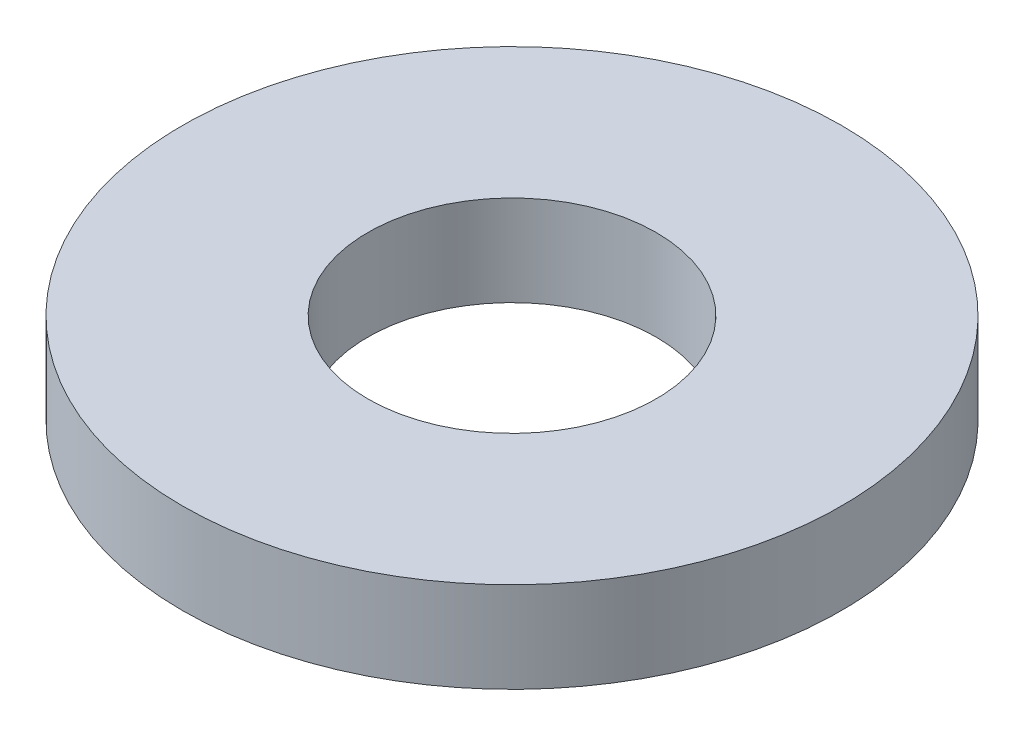
ISO-10303-21;
HEADER;
FILE_DESCRIPTION(('STEP AP214'),'2;1');
FILE_NAME('part.step','',(''),(''),'','','');
FILE_SCHEMA(('AUTOMOTIVE_DESIGN { 1 0 10303 214 1 1 1 1 }'));
ENDSEC;
DATA;
#1=APPLICATION_CONTEXT('core data for automotive mechanical design processes');
#2=APPLICATION_PROTOCOL_DEFINITION('international standard','automotive_design',2000,#1);
#3=PRODUCT_CONTEXT('',#1,'mechanical');
#4=PRODUCT('Part','Part','',(#3));
#5=PRODUCT_RELATED_PRODUCT_CATEGORY('part','',(#4));
#6=PRODUCT_DEFINITION_FORMATION('','',#4);
#7=PRODUCT_DEFINITION_CONTEXT('part definition',#1,'design');
#8=PRODUCT_DEFINITION('design','',#6,#7);
#9=PRODUCT_DEFINITION_SHAPE('','',#8);
#10=(LENGTH_UNIT() NAMED_UNIT(*) SI_UNIT(.MILLI.,.METRE.));
#11=(NAMED_UNIT(*) PLANE_ANGLE_UNIT() SI_UNIT($,.RADIAN.));
#12=(NAMED_UNIT(*) SI_UNIT($,.STERADIAN.) SOLID_ANGLE_UNIT());
#13=UNCERTAINTY_MEASURE_WITH_UNIT(LENGTH_MEASURE(1.E-05),#10,'distance_accuracy_value','');
#14=(GEOMETRIC_REPRESENTATION_CONTEXT(3) GLOBAL_UNCERTAINTY_ASSIGNED_CONTEXT((#13)) GLOBAL_UNIT_ASSIGNED_CONTEXT((#10,
#11,#12)) REPRESENTATION_CONTEXT('',''));
#15=CARTESIAN_POINT('',(0.,0.,0.));
#16=DIRECTION('',(0.,0.,1.));
#17=DIRECTION('',(1.,0.,0.));
#18=AXIS2_PLACEMENT_3D('',#15,#16,#17);
#19=CARTESIAN_POINT('',(0.,22.,0.));
#20=DIRECTION('',(0.,-1.,0.));
#21=DIRECTION('',(0.,0.,-1.));
#22=AXIS2_PLACEMENT_3D('',#19,#20,#21);
#23=CYLINDRICAL_SURFACE('',#22,80.);
#24=CARTESIAN_POINT('',(0.,22.,0.));
#25=DIRECTION('',(0.,1.,0.));
#26=DIRECTION('',(0.,0.,1.));
#27=AXIS2_PLACEMENT_3D('',#24,#25,#26);
#28=CIRCLE('',#27,80.);
#29=CARTESIAN_POINT('',(0.,22.,80.));
#30=VERTEX_POINT('',#29);
#31=EDGE_CURVE('E10',#30,#30,#28,.T.);
#32=ORIENTED_EDGE('',*,*,#31,.F.);
#33=EDGE_LOOP('',(#32));
#34=FACE_BOUND('',#33,.T.);
#35=CARTESIAN_POINT('',(0.,0.,0.));
#36=DIRECTION('',(0.,1.,0.));
#37=DIRECTION('',(0.,0.,1.));
#38=AXIS2_PLACEMENT_3D('',#35,#36,#37);
#39=CIRCLE('',#38,80.);
#40=CARTESIAN_POINT('',(0.,0.,80.));
#41=VERTEX_POINT('',#40);
#42=EDGE_CURVE('E37',#41,#41,#39,.T.);
#43=ORIENTED_EDGE('',*,*,#42,.T.);
#44=EDGE_LOOP('',(#43));
#45=FACE_BOUND('',#44,.T.);
#46=ADVANCED_FACE('F40',(#34,#45),#23,.T.);
#47=CARTESIAN_POINT('',(0.,22.,0.));
#48=DIRECTION('',(0.,1.,0.));
#49=DIRECTION('',(0.,0.,1.));
#50=AXIS2_PLACEMENT_3D('',#47,#48,#49);
#51=PLANE('',#50);
#52=CARTESIAN_POINT('',(0.,22.,0.));
#53=DIRECTION('',(0.,1.,0.));
#54=DIRECTION('',(0.,0.,1.));
#55=AXIS2_PLACEMENT_3D('',#52,#53,#54);
#56=CIRCLE('',#55,35.);
#57=CARTESIAN_POINT('',(0.,22.,35.));
#58=VERTEX_POINT('',#57);
#59=EDGE_CURVE('E50',#58,#58,#56,.T.);
#60=ORIENTED_EDGE('',*,*,#59,.F.);
#61=EDGE_LOOP('',(#60));
#62=FACE_BOUND('',#61,.T.);
#63=ORIENTED_EDGE('',*,*,#31,.T.);
#64=EDGE_LOOP('',(#63));
#65=FACE_BOUND('',#64,.T.);
#66=ADVANCED_FACE('F59',(#62,#65),#51,.T.);
#67=CARTESIAN_POINT('',(0.,0.,0.));
#68=DIRECTION('',(0.,1.,0.));
#69=DIRECTION('',(0.,0.,1.));
#70=AXIS2_PLACEMENT_3D('',#67,#68,#69);
#71=PLANE('',#70);
#72=CARTESIAN_POINT('',(0.,0.,0.));
#73=DIRECTION('',(0.,1.,0.));
#74=DIRECTION('',(0.,0.,1.));
#75=AXIS2_PLACEMENT_3D('',#72,#73,#74);
#76=CIRCLE('',#75,35.);
#77=CARTESIAN_POINT('',(0.,0.,35.));
#78=VERTEX_POINT('',#77);
#79=EDGE_CURVE('E47',#78,#78,#76,.T.);
#80=ORIENTED_EDGE('',*,*,#79,.T.);
#81=EDGE_LOOP('',(#80));
#82=FACE_BOUND('',#81,.T.);
#83=ORIENTED_EDGE('',*,*,#42,.F.);
#84=EDGE_LOOP('',(#83));
#85=FACE_BOUND('',#84,.T.);
#86=ADVANCED_FACE('F58',(#82,#85),#71,.F.);
#87=CARTESIAN_POINT('',(0.,22.,0.));
#88=DIRECTION('',(0.,-1.,0.));
#89=DIRECTION('',(0.,0.,-1.));
#90=AXIS2_PLACEMENT_3D('',#87,#88,#89);
#91=CYLINDRICAL_SURFACE('',#90,35.);
#92=ORIENTED_EDGE('',*,*,#59,.T.);
#93=EDGE_LOOP('',(#92));
#94=FACE_BOUND('',#93,.T.);
#95=ORIENTED_EDGE('',*,*,#79,.F.);
#96=EDGE_LOOP('',(#95));
#97=FACE_BOUND('',#96,.T.);
#98=ADVANCED_FACE('F54',(#94,#97),#91,.F.);
#99=CLOSED_SHELL('',(#46,#66,#86,#98));
#100=MANIFOLD_SOLID_BREP('B2',#99);
#101=ADVANCED_BREP_SHAPE_REPRESENTATION('',(#18,#100),#14);
#102=SHAPE_DEFINITION_REPRESENTATION(#9,#101);
ENDSEC;
END-ISO-10303-21;
